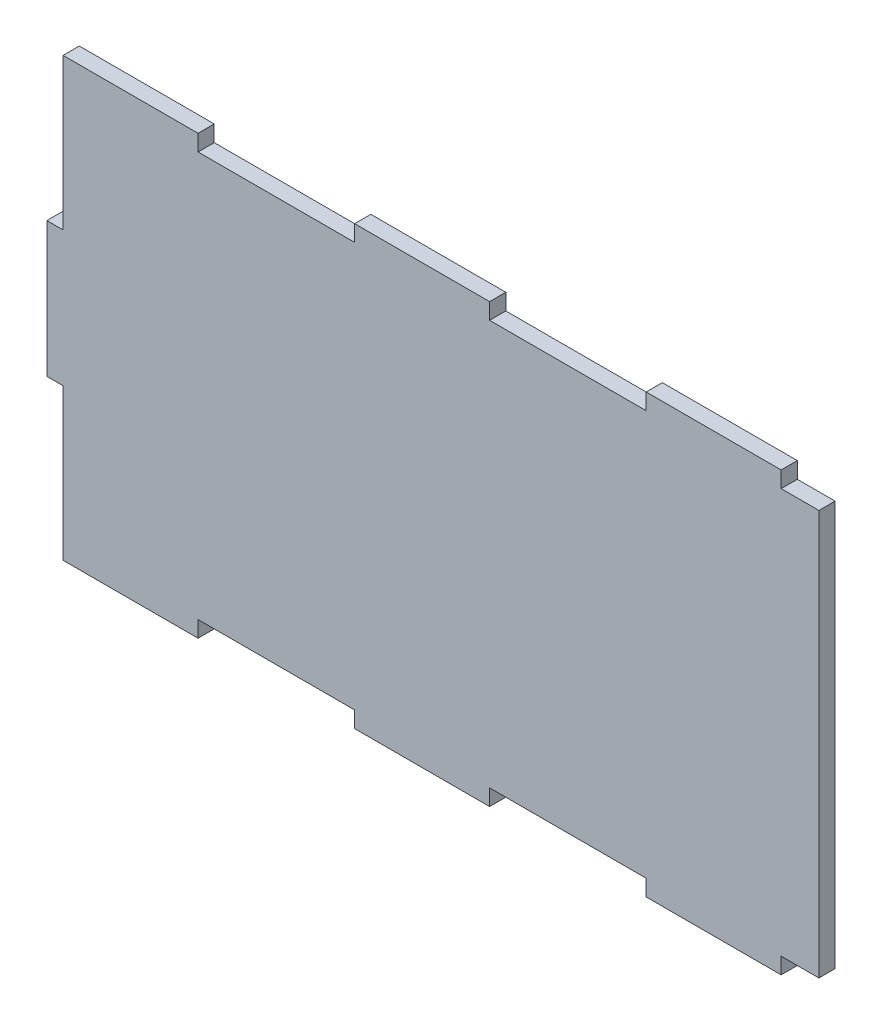
ISO-10303-21;
HEADER;
FILE_DESCRIPTION(('STEP AP214'),'2;1');
FILE_NAME('part.step','',(''),(''),'','','');
FILE_SCHEMA(('AUTOMOTIVE_DESIGN { 1 0 10303 214 1 1 1 1 }'));
ENDSEC;
DATA;
#1=APPLICATION_CONTEXT('core data for automotive mechanical design processes');
#2=APPLICATION_PROTOCOL_DEFINITION('international standard','automotive_design',2000,#1);
#3=PRODUCT_CONTEXT('',#1,'mechanical');
#4=PRODUCT('Part','Part','',(#3));
#5=PRODUCT_RELATED_PRODUCT_CATEGORY('part','',(#4));
#6=PRODUCT_DEFINITION_FORMATION('','',#4);
#7=PRODUCT_DEFINITION_CONTEXT('part definition',#1,'design');
#8=PRODUCT_DEFINITION('design','',#6,#7);
#9=PRODUCT_DEFINITION_SHAPE('','',#8);
#10=(LENGTH_UNIT() NAMED_UNIT(*) SI_UNIT(.MILLI.,.METRE.));
#11=(NAMED_UNIT(*) PLANE_ANGLE_UNIT() SI_UNIT($,.RADIAN.));
#12=(NAMED_UNIT(*) SI_UNIT($,.STERADIAN.) SOLID_ANGLE_UNIT());
#13=UNCERTAINTY_MEASURE_WITH_UNIT(LENGTH_MEASURE(1.E-05),#10,'distance_accuracy_value','');
#14=(GEOMETRIC_REPRESENTATION_CONTEXT(3) GLOBAL_UNCERTAINTY_ASSIGNED_CONTEXT((#13)) GLOBAL_UNIT_ASSIGNED_CONTEXT((#10,
#11,#12)) REPRESENTATION_CONTEXT('',''));
#15=CARTESIAN_POINT('',(0.,0.,0.));
#16=DIRECTION('',(0.,0.,1.));
#17=DIRECTION('',(1.,0.,0.));
#18=AXIS2_PLACEMENT_3D('',#15,#16,#17);
#19=CARTESIAN_POINT('',(133.,0.,6.));
#20=DIRECTION('',(1.,0.,0.));
#21=DIRECTION('',(0.,0.,-1.));
#22=AXIS2_PLACEMENT_3D('',#19,#20,#21);
#23=PLANE('',#22);
#24=DIRECTION('',(0.,-1.,0.));
#25=VECTOR('',#24,1.);
#26=CARTESIAN_POINT('',(133.,0.,0.));
#27=LINE('',#26,#25);
#28=CARTESIAN_POINT('',(133.,-75.,0.));
#29=VERTEX_POINT('',#28);
#30=CARTESIAN_POINT('',(133.,-81.,0.));
#31=VERTEX_POINT('',#30);
#32=EDGE_CURVE('E171',#29,#31,#27,.T.);
#33=ORIENTED_EDGE('',*,*,#32,.F.);
#34=DIRECTION('',(0.,0.,1.));
#35=VECTOR('',#34,1.);
#36=CARTESIAN_POINT('',(133.,-75.,0.));
#37=LINE('',#36,#35);
#38=CARTESIAN_POINT('',(133.,-75.,6.));
#39=VERTEX_POINT('',#38);
#40=EDGE_CURVE('E370',#29,#39,#37,.T.);
#41=ORIENTED_EDGE('',*,*,#40,.T.);
#42=DIRECTION('',(0.,-1.,0.));
#43=VECTOR('',#42,1.);
#44=CARTESIAN_POINT('',(133.,0.,6.));
#45=LINE('',#44,#43);
#46=CARTESIAN_POINT('',(133.,-81.,6.));
#47=VERTEX_POINT('',#46);
#48=EDGE_CURVE('E255',#39,#47,#45,.T.);
#49=ORIENTED_EDGE('',*,*,#48,.T.);
#50=DIRECTION('',(0.,0.,-1.));
#51=VECTOR('',#50,1.);
#52=CARTESIAN_POINT('',(133.,-81.,6.));
#53=LINE('',#52,#51);
#54=EDGE_CURVE('E248',#47,#31,#53,.T.);
#55=ORIENTED_EDGE('',*,*,#54,.T.);
#56=EDGE_LOOP('',(#33,#41,#49,#55));
#57=FACE_BOUND('',#56,.T.);
#58=ADVANCED_FACE('F113',(#57),#23,.T.);
#59=CARTESIAN_POINT('',(0.,75.,6.));
#60=DIRECTION('',(0.,1.,0.));
#61=DIRECTION('',(-1.,0.,0.));
#62=AXIS2_PLACEMENT_3D('',#59,#60,#61);
#63=PLANE('',#62);
#64=DIRECTION('',(0.,0.,1.));
#65=VECTOR('',#64,1.);
#66=CARTESIAN_POINT('',(83.0000000000001,75.,6.));
#67=LINE('',#66,#65);
#68=CARTESIAN_POINT('',(83.0000000000001,75.,0.));
#69=VERTEX_POINT('',#68);
#70=CARTESIAN_POINT('',(83.0000000000001,75.,6.));
#71=VERTEX_POINT('',#70);
#72=EDGE_CURVE('E12',#69,#71,#67,.T.);
#73=ORIENTED_EDGE('',*,*,#72,.F.);
#74=DIRECTION('',(1.,0.,0.));
#75=VECTOR('',#74,1.);
#76=CARTESIAN_POINT('',(0.,75.,0.));
#77=LINE('',#76,#75);
#78=CARTESIAN_POINT('',(25.,75.,0.));
#79=VERTEX_POINT('',#78);
#80=EDGE_CURVE('E170',#79,#69,#77,.T.);
#81=ORIENTED_EDGE('',*,*,#80,.F.);
#82=DIRECTION('',(0.,0.,-1.));
#83=VECTOR('',#82,1.);
#84=CARTESIAN_POINT('',(25.,75.,6.));
#85=LINE('',#84,#83);
#86=CARTESIAN_POINT('',(25.,75.,6.));
#87=VERTEX_POINT('',#86);
#88=EDGE_CURVE('E122',#87,#79,#85,.T.);
#89=ORIENTED_EDGE('',*,*,#88,.F.);
#90=DIRECTION('',(1.,0.,0.));
#91=VECTOR('',#90,1.);
#92=CARTESIAN_POINT('',(0.,75.,6.));
#93=LINE('',#92,#91);
#94=EDGE_CURVE('E365',#87,#71,#93,.T.);
#95=ORIENTED_EDGE('',*,*,#94,.T.);
#96=EDGE_LOOP('',(#73,#81,#89,#95));
#97=FACE_BOUND('',#96,.T.);
#98=ADVANCED_FACE('F612',(#97),#63,.T.);
#99=CARTESIAN_POINT('',(25.,0.,6.));
#100=DIRECTION('',(-1.,0.,0.));
#101=DIRECTION('',(0.,0.,1.));
#102=AXIS2_PLACEMENT_3D('',#99,#100,#101);
#103=PLANE('',#102);
#104=DIRECTION('',(0.,1.,0.));
#105=VECTOR('',#104,1.);
#106=CARTESIAN_POINT('',(25.,0.,0.));
#107=LINE('',#106,#105);
#108=CARTESIAN_POINT('',(25.,81.,0.));
#109=VERTEX_POINT('',#108);
#110=EDGE_CURVE('E306',#79,#109,#107,.T.);
#111=ORIENTED_EDGE('',*,*,#110,.T.);
#112=DIRECTION('',(0.,0.,-1.));
#113=VECTOR('',#112,1.);
#114=CARTESIAN_POINT('',(25.,81.,6.));
#115=LINE('',#114,#113);
#116=CARTESIAN_POINT('',(25.,81.,6.));
#117=VERTEX_POINT('',#116);
#118=EDGE_CURVE('E191',#117,#109,#115,.T.);
#119=ORIENTED_EDGE('',*,*,#118,.F.);
#120=DIRECTION('',(0.,1.,0.));
#121=VECTOR('',#120,1.);
#122=CARTESIAN_POINT('',(25.,0.,6.));
#123=LINE('',#122,#121);
#124=EDGE_CURVE('E362',#87,#117,#123,.T.);
#125=ORIENTED_EDGE('',*,*,#124,.F.);
#126=ORIENTED_EDGE('',*,*,#88,.T.);
#127=EDGE_LOOP('',(#111,#119,#125,#126));
#128=FACE_BOUND('',#127,.T.);
#129=ADVANCED_FACE('F609',(#128),#103,.F.);
#130=CARTESIAN_POINT('',(0.,81.,6.));
#131=DIRECTION('',(0.,1.,0.));
#132=DIRECTION('',(0.,0.,1.));
#133=AXIS2_PLACEMENT_3D('',#130,#131,#132);
#134=PLANE('',#133);
#135=DIRECTION('',(1.,0.,0.));
#136=VECTOR('',#135,1.);
#137=CARTESIAN_POINT('',(0.,81.,0.));
#138=LINE('',#137,#136);
#139=CARTESIAN_POINT('',(-25.,81.,0.));
#140=VERTEX_POINT('',#139);
#141=EDGE_CURVE('E303',#140,#109,#138,.T.);
#142=ORIENTED_EDGE('',*,*,#141,.F.);
#143=DIRECTION('',(0.,0.,-1.));
#144=VECTOR('',#143,1.);
#145=CARTESIAN_POINT('',(-25.,81.,6.));
#146=LINE('',#145,#144);
#147=CARTESIAN_POINT('',(-25.,81.,6.));
#148=VERTEX_POINT('',#147);
#149=EDGE_CURVE('E194',#148,#140,#146,.T.);
#150=ORIENTED_EDGE('',*,*,#149,.F.);
#151=DIRECTION('',(1.,0.,0.));
#152=VECTOR('',#151,1.);
#153=CARTESIAN_POINT('',(0.,81.,6.));
#154=LINE('',#153,#152);
#155=EDGE_CURVE('E359',#148,#117,#154,.T.);
#156=ORIENTED_EDGE('',*,*,#155,.T.);
#157=ORIENTED_EDGE('',*,*,#118,.T.);
#158=EDGE_LOOP('',(#142,#150,#156,#157));
#159=FACE_BOUND('',#158,.T.);
#160=ADVANCED_FACE('F604',(#159),#134,.T.);
#161=CARTESIAN_POINT('',(-25.,0.,6.));
#162=DIRECTION('',(-1.,0.,0.));
#163=DIRECTION('',(0.,0.,1.));
#164=AXIS2_PLACEMENT_3D('',#161,#162,#163);
#165=PLANE('',#164);
#166=DIRECTION('',(0.,1.,0.));
#167=VECTOR('',#166,1.);
#168=CARTESIAN_POINT('',(-25.,0.,0.));
#169=LINE('',#168,#167);
#170=CARTESIAN_POINT('',(-25.,75.,0.));
#171=VERTEX_POINT('',#170);
#172=EDGE_CURVE('E300',#171,#140,#169,.T.);
#173=ORIENTED_EDGE('',*,*,#172,.F.);
#174=DIRECTION('',(0.,0.,-1.));
#175=VECTOR('',#174,1.);
#176=CARTESIAN_POINT('',(-25.,75.,6.));
#177=LINE('',#176,#175);
#178=CARTESIAN_POINT('',(-25.,75.,6.));
#179=VERTEX_POINT('',#178);
#180=EDGE_CURVE('E197',#179,#171,#177,.T.);
#181=ORIENTED_EDGE('',*,*,#180,.F.);
#182=DIRECTION('',(0.,1.,0.));
#183=VECTOR('',#182,1.);
#184=CARTESIAN_POINT('',(-25.,0.,6.));
#185=LINE('',#184,#183);
#186=EDGE_CURVE('E356',#179,#148,#185,.T.);
#187=ORIENTED_EDGE('',*,*,#186,.T.);
#188=ORIENTED_EDGE('',*,*,#149,.T.);
#189=EDGE_LOOP('',(#173,#181,#187,#188));
#190=FACE_BOUND('',#189,.T.);
#191=ADVANCED_FACE('F599',(#190),#165,.T.);
#192=CARTESIAN_POINT('',(-82.9999999999999,75.,0.));
#193=VERTEX_POINT('',#192);
#194=EDGE_CURVE('E299',#193,#171,#77,.T.);
#195=ORIENTED_EDGE('',*,*,#194,.F.);
#196=DIRECTION('',(0.,0.,-1.));
#197=VECTOR('',#196,1.);
#198=CARTESIAN_POINT('',(-82.9999999999999,75.,6.));
#199=LINE('',#198,#197);
#200=CARTESIAN_POINT('',(-82.9999999999999,75.,6.));
#201=VERTEX_POINT('',#200);
#202=EDGE_CURVE('E200',#201,#193,#199,.T.);
#203=ORIENTED_EDGE('',*,*,#202,.F.);
#204=EDGE_CURVE('E355',#201,#179,#93,.T.);
#205=ORIENTED_EDGE('',*,*,#204,.T.);
#206=ORIENTED_EDGE('',*,*,#180,.T.);
#207=EDGE_LOOP('',(#195,#203,#205,#206));
#208=FACE_BOUND('',#207,.T.);
#209=ADVANCED_FACE('F593',(#208),#63,.T.);
#210=CARTESIAN_POINT('',(-82.9999999999999,0.,6.));
#211=DIRECTION('',(-1.,0.,0.));
#212=DIRECTION('',(0.,0.,1.));
#213=AXIS2_PLACEMENT_3D('',#210,#211,#212);
#214=PLANE('',#213);
#215=DIRECTION('',(0.,1.,0.));
#216=VECTOR('',#215,1.);
#217=CARTESIAN_POINT('',(-82.9999999999999,0.,0.));
#218=LINE('',#217,#216);
#219=CARTESIAN_POINT('',(-82.9999999999999,81.,0.));
#220=VERTEX_POINT('',#219);
#221=EDGE_CURVE('E296',#193,#220,#218,.T.);
#222=ORIENTED_EDGE('',*,*,#221,.T.);
#223=DIRECTION('',(0.,0.,-1.));
#224=VECTOR('',#223,1.);
#225=CARTESIAN_POINT('',(-82.9999999999999,81.,6.));
#226=LINE('',#225,#224);
#227=CARTESIAN_POINT('',(-82.9999999999999,81.,6.));
#228=VERTEX_POINT('',#227);
#229=EDGE_CURVE('E203',#228,#220,#226,.T.);
#230=ORIENTED_EDGE('',*,*,#229,.F.);
#231=DIRECTION('',(0.,1.,0.));
#232=VECTOR('',#231,1.);
#233=CARTESIAN_POINT('',(-82.9999999999999,0.,6.));
#234=LINE('',#233,#232);
#235=EDGE_CURVE('E352',#201,#228,#234,.T.);
#236=ORIENTED_EDGE('',*,*,#235,.F.);
#237=ORIENTED_EDGE('',*,*,#202,.T.);
#238=EDGE_LOOP('',(#222,#230,#236,#237));
#239=FACE_BOUND('',#238,.T.);
#240=ADVANCED_FACE('F589',(#239),#214,.F.);
#241=CARTESIAN_POINT('',(0.,81.,6.));
#242=DIRECTION('',(0.,1.,0.));
#243=DIRECTION('',(0.,0.,1.));
#244=AXIS2_PLACEMENT_3D('',#241,#242,#243);
#245=PLANE('',#244);
#246=DIRECTION('',(1.,0.,0.));
#247=VECTOR('',#246,1.);
#248=CARTESIAN_POINT('',(0.,81.,0.));
#249=LINE('',#248,#247);
#250=CARTESIAN_POINT('',(-133.,81.,0.));
#251=VERTEX_POINT('',#250);
#252=EDGE_CURVE('E293',#251,#220,#249,.T.);
#253=ORIENTED_EDGE('',*,*,#252,.F.);
#254=DIRECTION('',(0.,0.,-1.));
#255=VECTOR('',#254,1.);
#256=CARTESIAN_POINT('',(-133.,81.,6.));
#257=LINE('',#256,#255);
#258=CARTESIAN_POINT('',(-133.,81.,6.));
#259=VERTEX_POINT('',#258);
#260=EDGE_CURVE('E206',#259,#251,#257,.T.);
#261=ORIENTED_EDGE('',*,*,#260,.F.);
#262=DIRECTION('',(1.,0.,0.));
#263=VECTOR('',#262,1.);
#264=CARTESIAN_POINT('',(0.,81.,6.));
#265=LINE('',#264,#263);
#266=EDGE_CURVE('E349',#259,#228,#265,.T.);
#267=ORIENTED_EDGE('',*,*,#266,.T.);
#268=ORIENTED_EDGE('',*,*,#229,.T.);
#269=EDGE_LOOP('',(#253,#261,#267,#268));
#270=FACE_BOUND('',#269,.T.);
#271=ADVANCED_FACE('F584',(#270),#245,.T.);
#272=CARTESIAN_POINT('',(-133.,0.,6.));
#273=DIRECTION('',(1.,0.,0.));
#274=DIRECTION('',(0.,0.,-1.));
#275=AXIS2_PLACEMENT_3D('',#272,#273,#274);
#276=PLANE('',#275);
#277=DIRECTION('',(0.,-1.,0.));
#278=VECTOR('',#277,1.);
#279=CARTESIAN_POINT('',(-133.,0.,0.));
#280=LINE('',#279,#278);
#281=CARTESIAN_POINT('',(-133.,25.,0.));
#282=VERTEX_POINT('',#281);
#283=EDGE_CURVE('E290',#251,#282,#280,.T.);
#284=ORIENTED_EDGE('',*,*,#283,.T.);
#285=DIRECTION('',(0.,0.,-1.));
#286=VECTOR('',#285,1.);
#287=CARTESIAN_POINT('',(-133.,25.,6.));
#288=LINE('',#287,#286);
#289=CARTESIAN_POINT('',(-133.,25.,6.));
#290=VERTEX_POINT('',#289);
#291=EDGE_CURVE('E209',#290,#282,#288,.T.);
#292=ORIENTED_EDGE('',*,*,#291,.F.);
#293=DIRECTION('',(0.,-1.,0.));
#294=VECTOR('',#293,1.);
#295=CARTESIAN_POINT('',(-133.,0.,6.));
#296=LINE('',#295,#294);
#297=EDGE_CURVE('E346',#259,#290,#296,.T.);
#298=ORIENTED_EDGE('',*,*,#297,.F.);
#299=ORIENTED_EDGE('',*,*,#260,.T.);
#300=EDGE_LOOP('',(#284,#292,#298,#299));
#301=FACE_BOUND('',#300,.T.);
#302=ADVANCED_FACE('F580',(#301),#276,.F.);
#303=CARTESIAN_POINT('',(0.,25.,6.));
#304=DIRECTION('',(0.,1.,0.));
#305=DIRECTION('',(0.,0.,1.));
#306=AXIS2_PLACEMENT_3D('',#303,#304,#305);
#307=PLANE('',#306);
#308=DIRECTION('',(1.,0.,0.));
#309=VECTOR('',#308,1.);
#310=CARTESIAN_POINT('',(0.,25.,0.));
#311=LINE('',#310,#309);
#312=CARTESIAN_POINT('',(-139.,25.,0.));
#313=VERTEX_POINT('',#312);
#314=EDGE_CURVE('E287',#313,#282,#311,.T.);
#315=ORIENTED_EDGE('',*,*,#314,.F.);
#316=DIRECTION('',(0.,0.,-1.));
#317=VECTOR('',#316,1.);
#318=CARTESIAN_POINT('',(-139.,25.,6.));
#319=LINE('',#318,#317);
#320=CARTESIAN_POINT('',(-139.,25.,6.));
#321=VERTEX_POINT('',#320);
#322=EDGE_CURVE('E212',#321,#313,#319,.T.);
#323=ORIENTED_EDGE('',*,*,#322,.F.);
#324=DIRECTION('',(1.,0.,0.));
#325=VECTOR('',#324,1.);
#326=CARTESIAN_POINT('',(0.,25.,6.));
#327=LINE('',#326,#325);
#328=EDGE_CURVE('E343',#321,#290,#327,.T.);
#329=ORIENTED_EDGE('',*,*,#328,.T.);
#330=ORIENTED_EDGE('',*,*,#291,.T.);
#331=EDGE_LOOP('',(#315,#323,#329,#330));
#332=FACE_BOUND('',#331,.T.);
#333=ADVANCED_FACE('F574',(#332),#307,.T.);
#334=CARTESIAN_POINT('',(-139.,0.,6.));
#335=DIRECTION('',(1.,0.,0.));
#336=DIRECTION('',(0.,0.,-1.));
#337=AXIS2_PLACEMENT_3D('',#334,#335,#336);
#338=PLANE('',#337);
#339=DIRECTION('',(0.,-1.,0.));
#340=VECTOR('',#339,1.);
#341=CARTESIAN_POINT('',(-139.,0.,0.));
#342=LINE('',#341,#340);
#343=CARTESIAN_POINT('',(-139.,-25.,0.));
#344=VERTEX_POINT('',#343);
#345=EDGE_CURVE('E284',#313,#344,#342,.T.);
#346=ORIENTED_EDGE('',*,*,#345,.T.);
#347=DIRECTION('',(0.,0.,-1.));
#348=VECTOR('',#347,1.);
#349=CARTESIAN_POINT('',(-139.,-25.,6.));
#350=LINE('',#349,#348);
#351=CARTESIAN_POINT('',(-139.,-25.,6.));
#352=VERTEX_POINT('',#351);
#353=EDGE_CURVE('E215',#352,#344,#350,.T.);
#354=ORIENTED_EDGE('',*,*,#353,.F.);
#355=DIRECTION('',(0.,-1.,0.));
#356=VECTOR('',#355,1.);
#357=CARTESIAN_POINT('',(-139.,0.,6.));
#358=LINE('',#357,#356);
#359=EDGE_CURVE('E340',#321,#352,#358,.T.);
#360=ORIENTED_EDGE('',*,*,#359,.F.);
#361=ORIENTED_EDGE('',*,*,#322,.T.);
#362=EDGE_LOOP('',(#346,#354,#360,#361));
#363=FACE_BOUND('',#362,.T.);
#364=ADVANCED_FACE('F613',(#363),#338,.F.);
#365=CARTESIAN_POINT('',(0.,-25.,6.));
#366=DIRECTION('',(0.,1.,0.));
#367=DIRECTION('',(0.,0.,1.));
#368=AXIS2_PLACEMENT_3D('',#365,#366,#367);
#369=PLANE('',#368);
#370=DIRECTION('',(1.,0.,0.));
#371=VECTOR('',#370,1.);
#372=CARTESIAN_POINT('',(0.,-25.,0.));
#373=LINE('',#372,#371);
#374=CARTESIAN_POINT('',(-133.,-25.,0.));
#375=VERTEX_POINT('',#374);
#376=EDGE_CURVE('E281',#344,#375,#373,.T.);
#377=ORIENTED_EDGE('',*,*,#376,.T.);
#378=DIRECTION('',(0.,0.,-1.));
#379=VECTOR('',#378,1.);
#380=CARTESIAN_POINT('',(-133.,-25.,6.));
#381=LINE('',#380,#379);
#382=CARTESIAN_POINT('',(-133.,-25.,6.));
#383=VERTEX_POINT('',#382);
#384=EDGE_CURVE('E218',#383,#375,#381,.T.);
#385=ORIENTED_EDGE('',*,*,#384,.F.);
#386=DIRECTION('',(1.,0.,0.));
#387=VECTOR('',#386,1.);
#388=CARTESIAN_POINT('',(0.,-25.,6.));
#389=LINE('',#388,#387);
#390=EDGE_CURVE('E337',#352,#383,#389,.T.);
#391=ORIENTED_EDGE('',*,*,#390,.F.);
#392=ORIENTED_EDGE('',*,*,#353,.T.);
#393=EDGE_LOOP('',(#377,#385,#391,#392));
#394=FACE_BOUND('',#393,.T.);
#395=ADVANCED_FACE('F567',(#394),#369,.F.);
#396=CARTESIAN_POINT('',(-133.,0.,6.));
#397=DIRECTION('',(1.,0.,0.));
#398=DIRECTION('',(0.,0.,-1.));
#399=AXIS2_PLACEMENT_3D('',#396,#397,#398);
#400=PLANE('',#399);
#401=DIRECTION('',(0.,-1.,0.));
#402=VECTOR('',#401,1.);
#403=CARTESIAN_POINT('',(-133.,0.,0.));
#404=LINE('',#403,#402);
#405=CARTESIAN_POINT('',(-133.,-81.,0.));
#406=VERTEX_POINT('',#405);
#407=EDGE_CURVE('E278',#375,#406,#404,.T.);
#408=ORIENTED_EDGE('',*,*,#407,.T.);
#409=DIRECTION('',(0.,0.,-1.));
#410=VECTOR('',#409,1.);
#411=CARTESIAN_POINT('',(-133.,-81.,6.));
#412=LINE('',#411,#410);
#413=CARTESIAN_POINT('',(-133.,-81.,6.));
#414=VERTEX_POINT('',#413);
#415=EDGE_CURVE('E221',#414,#406,#412,.T.);
#416=ORIENTED_EDGE('',*,*,#415,.F.);
#417=DIRECTION('',(0.,-1.,0.));
#418=VECTOR('',#417,1.);
#419=CARTESIAN_POINT('',(-133.,0.,6.));
#420=LINE('',#419,#418);
#421=EDGE_CURVE('E334',#383,#414,#420,.T.);
#422=ORIENTED_EDGE('',*,*,#421,.F.);
#423=ORIENTED_EDGE('',*,*,#384,.T.);
#424=EDGE_LOOP('',(#408,#416,#422,#423));
#425=FACE_BOUND('',#424,.T.);
#426=ADVANCED_FACE('F563',(#425),#400,.F.);
#427=CARTESIAN_POINT('',(0.,-81.,6.));
#428=DIRECTION('',(0.,1.,0.));
#429=DIRECTION('',(0.,0.,1.));
#430=AXIS2_PLACEMENT_3D('',#427,#428,#429);
#431=PLANE('',#430);
#432=DIRECTION('',(1.,0.,0.));
#433=VECTOR('',#432,1.);
#434=CARTESIAN_POINT('',(0.,-81.,0.));
#435=LINE('',#434,#433);
#436=CARTESIAN_POINT('',(-82.9999999999999,-81.,0.));
#437=VERTEX_POINT('',#436);
#438=EDGE_CURVE('E275',#406,#437,#435,.T.);
#439=ORIENTED_EDGE('',*,*,#438,.T.);
#440=DIRECTION('',(0.,0.,-1.));
#441=VECTOR('',#440,1.);
#442=CARTESIAN_POINT('',(-82.9999999999999,-81.,6.));
#443=LINE('',#442,#441);
#444=CARTESIAN_POINT('',(-82.9999999999999,-81.,6.));
#445=VERTEX_POINT('',#444);
#446=EDGE_CURVE('E224',#445,#437,#443,.T.);
#447=ORIENTED_EDGE('',*,*,#446,.F.);
#448=DIRECTION('',(1.,0.,0.));
#449=VECTOR('',#448,1.);
#450=CARTESIAN_POINT('',(0.,-81.,6.));
#451=LINE('',#450,#449);
#452=EDGE_CURVE('E331',#414,#445,#451,.T.);
#453=ORIENTED_EDGE('',*,*,#452,.F.);
#454=ORIENTED_EDGE('',*,*,#415,.T.);
#455=EDGE_LOOP('',(#439,#447,#453,#454));
#456=FACE_BOUND('',#455,.T.);
#457=ADVANCED_FACE('F558',(#456),#431,.F.);
#458=CARTESIAN_POINT('',(-82.9999999999999,0.,6.));
#459=DIRECTION('',(1.,0.,0.));
#460=DIRECTION('',(0.,0.,-1.));
#461=AXIS2_PLACEMENT_3D('',#458,#459,#460);
#462=PLANE('',#461);
#463=DIRECTION('',(0.,-1.,0.));
#464=VECTOR('',#463,1.);
#465=CARTESIAN_POINT('',(-82.9999999999999,0.,0.));
#466=LINE('',#465,#464);
#467=CARTESIAN_POINT('',(-82.9999999999999,-75.,0.));
#468=VERTEX_POINT('',#467);
#469=EDGE_CURVE('E272',#468,#437,#466,.T.);
#470=ORIENTED_EDGE('',*,*,#469,.F.);
#471=DIRECTION('',(0.,0.,-1.));
#472=VECTOR('',#471,1.);
#473=CARTESIAN_POINT('',(-82.9999999999999,-75.,6.));
#474=LINE('',#473,#472);
#475=CARTESIAN_POINT('',(-82.9999999999999,-75.,6.));
#476=VERTEX_POINT('',#475);
#477=EDGE_CURVE('E227',#476,#468,#474,.T.);
#478=ORIENTED_EDGE('',*,*,#477,.F.);
#479=DIRECTION('',(0.,-1.,0.));
#480=VECTOR('',#479,1.);
#481=CARTESIAN_POINT('',(-82.9999999999999,0.,6.));
#482=LINE('',#481,#480);
#483=EDGE_CURVE('E328',#476,#445,#482,.T.);
#484=ORIENTED_EDGE('',*,*,#483,.T.);
#485=ORIENTED_EDGE('',*,*,#446,.T.);
#486=EDGE_LOOP('',(#470,#478,#484,#485));
#487=FACE_BOUND('',#486,.T.);
#488=ADVANCED_FACE('F552',(#487),#462,.T.);
#489=CARTESIAN_POINT('',(0.,-75.,6.));
#490=DIRECTION('',(0.,1.,0.));
#491=DIRECTION('',(-1.,0.,0.));
#492=AXIS2_PLACEMENT_3D('',#489,#490,#491);
#493=PLANE('',#492);
#494=DIRECTION('',(1.,0.,0.));
#495=VECTOR('',#494,1.);
#496=CARTESIAN_POINT('',(0.,-75.,0.));
#497=LINE('',#496,#495);
#498=CARTESIAN_POINT('',(-25.,-75.,0.));
#499=VERTEX_POINT('',#498);
#500=EDGE_CURVE('E269',#468,#499,#497,.T.);
#501=ORIENTED_EDGE('',*,*,#500,.T.);
#502=DIRECTION('',(0.,0.,-1.));
#503=VECTOR('',#502,1.);
#504=CARTESIAN_POINT('',(-25.,-75.,6.));
#505=LINE('',#504,#503);
#506=CARTESIAN_POINT('',(-25.,-75.,6.));
#507=VERTEX_POINT('',#506);
#508=EDGE_CURVE('E230',#507,#499,#505,.T.);
#509=ORIENTED_EDGE('',*,*,#508,.F.);
#510=DIRECTION('',(1.,0.,0.));
#511=VECTOR('',#510,1.);
#512=CARTESIAN_POINT('',(0.,-75.,6.));
#513=LINE('',#512,#511);
#514=EDGE_CURVE('E325',#476,#507,#513,.T.);
#515=ORIENTED_EDGE('',*,*,#514,.F.);
#516=ORIENTED_EDGE('',*,*,#477,.T.);
#517=EDGE_LOOP('',(#501,#509,#515,#516));
#518=FACE_BOUND('',#517,.T.);
#519=ADVANCED_FACE('F549',(#518),#493,.F.);
#520=CARTESIAN_POINT('',(-25.,0.,6.));
#521=DIRECTION('',(1.,0.,0.));
#522=DIRECTION('',(0.,0.,-1.));
#523=AXIS2_PLACEMENT_3D('',#520,#521,#522);
#524=PLANE('',#523);
#525=DIRECTION('',(0.,-1.,0.));
#526=VECTOR('',#525,1.);
#527=CARTESIAN_POINT('',(-25.,0.,0.));
#528=LINE('',#527,#526);
#529=CARTESIAN_POINT('',(-25.,-81.,0.));
#530=VERTEX_POINT('',#529);
#531=EDGE_CURVE('E266',#499,#530,#528,.T.);
#532=ORIENTED_EDGE('',*,*,#531,.T.);
#533=DIRECTION('',(0.,0.,-1.));
#534=VECTOR('',#533,1.);
#535=CARTESIAN_POINT('',(-25.,-81.,6.));
#536=LINE('',#535,#534);
#537=CARTESIAN_POINT('',(-25.,-81.,6.));
#538=VERTEX_POINT('',#537);
#539=EDGE_CURVE('E233',#538,#530,#536,.T.);
#540=ORIENTED_EDGE('',*,*,#539,.F.);
#541=DIRECTION('',(0.,-1.,0.));
#542=VECTOR('',#541,1.);
#543=CARTESIAN_POINT('',(-25.,0.,6.));
#544=LINE('',#543,#542);
#545=EDGE_CURVE('E322',#507,#538,#544,.T.);
#546=ORIENTED_EDGE('',*,*,#545,.F.);
#547=ORIENTED_EDGE('',*,*,#508,.T.);
#548=EDGE_LOOP('',(#532,#540,#546,#547));
#549=FACE_BOUND('',#548,.T.);
#550=ADVANCED_FACE('F544',(#549),#524,.F.);
#551=CARTESIAN_POINT('',(0.,-81.,6.));
#552=DIRECTION('',(0.,1.,0.));
#553=DIRECTION('',(0.,0.,1.));
#554=AXIS2_PLACEMENT_3D('',#551,#552,#553);
#555=PLANE('',#554);
#556=DIRECTION('',(1.,0.,0.));
#557=VECTOR('',#556,1.);
#558=CARTESIAN_POINT('',(0.,-81.,0.));
#559=LINE('',#558,#557);
#560=CARTESIAN_POINT('',(25.,-81.,0.));
#561=VERTEX_POINT('',#560);
#562=EDGE_CURVE('E263',#530,#561,#559,.T.);
#563=ORIENTED_EDGE('',*,*,#562,.T.);
#564=DIRECTION('',(0.,0.,-1.));
#565=VECTOR('',#564,1.);
#566=CARTESIAN_POINT('',(25.,-81.,6.));
#567=LINE('',#566,#565);
#568=CARTESIAN_POINT('',(25.,-81.,6.));
#569=VERTEX_POINT('',#568);
#570=EDGE_CURVE('E236',#569,#561,#567,.T.);
#571=ORIENTED_EDGE('',*,*,#570,.F.);
#572=DIRECTION('',(1.,0.,0.));
#573=VECTOR('',#572,1.);
#574=CARTESIAN_POINT('',(0.,-81.,6.));
#575=LINE('',#574,#573);
#576=EDGE_CURVE('E319',#538,#569,#575,.T.);
#577=ORIENTED_EDGE('',*,*,#576,.F.);
#578=ORIENTED_EDGE('',*,*,#539,.T.);
#579=EDGE_LOOP('',(#563,#571,#577,#578));
#580=FACE_BOUND('',#579,.T.);
#581=ADVANCED_FACE('F538',(#580),#555,.F.);
#582=CARTESIAN_POINT('',(25.,0.,6.));
#583=DIRECTION('',(1.,0.,0.));
#584=DIRECTION('',(0.,0.,-1.));
#585=AXIS2_PLACEMENT_3D('',#582,#583,#584);
#586=PLANE('',#585);
#587=DIRECTION('',(0.,-1.,0.));
#588=VECTOR('',#587,1.);
#589=CARTESIAN_POINT('',(25.,0.,0.));
#590=LINE('',#589,#588);
#591=CARTESIAN_POINT('',(25.,-75.,0.));
#592=VERTEX_POINT('',#591);
#593=EDGE_CURVE('E260',#592,#561,#590,.T.);
#594=ORIENTED_EDGE('',*,*,#593,.F.);
#595=DIRECTION('',(0.,0.,-1.));
#596=VECTOR('',#595,1.);
#597=CARTESIAN_POINT('',(25.,-75.,6.));
#598=LINE('',#597,#596);
#599=CARTESIAN_POINT('',(25.,-75.,6.));
#600=VERTEX_POINT('',#599);
#601=EDGE_CURVE('E239',#600,#592,#598,.T.);
#602=ORIENTED_EDGE('',*,*,#601,.F.);
#603=DIRECTION('',(0.,-1.,0.));
#604=VECTOR('',#603,1.);
#605=CARTESIAN_POINT('',(25.,0.,6.));
#606=LINE('',#605,#604);
#607=EDGE_CURVE('E316',#600,#569,#606,.T.);
#608=ORIENTED_EDGE('',*,*,#607,.T.);
#609=ORIENTED_EDGE('',*,*,#570,.T.);
#610=EDGE_LOOP('',(#594,#602,#608,#609));
#611=FACE_BOUND('',#610,.T.);
#612=ADVANCED_FACE('F534',(#611),#586,.T.);
#613=CARTESIAN_POINT('',(83.0000000000001,-75.,0.));
#614=VERTEX_POINT('',#613);
#615=EDGE_CURVE('E259',#592,#614,#497,.T.);
#616=ORIENTED_EDGE('',*,*,#615,.T.);
#617=DIRECTION('',(0.,0.,-1.));
#618=VECTOR('',#617,1.);
#619=CARTESIAN_POINT('',(83.0000000000001,-75.,6.));
#620=LINE('',#619,#618);
#621=CARTESIAN_POINT('',(83.0000000000001,-75.,6.));
#622=VERTEX_POINT('',#621);
#623=EDGE_CURVE('E242',#622,#614,#620,.T.);
#624=ORIENTED_EDGE('',*,*,#623,.F.);
#625=EDGE_CURVE('E315',#600,#622,#513,.T.);
#626=ORIENTED_EDGE('',*,*,#625,.F.);
#627=ORIENTED_EDGE('',*,*,#601,.T.);
#628=EDGE_LOOP('',(#616,#624,#626,#627));
#629=FACE_BOUND('',#628,.T.);
#630=ADVANCED_FACE('F530',(#629),#493,.F.);
#631=CARTESIAN_POINT('',(83.0000000000001,0.,6.));
#632=DIRECTION('',(1.,0.,0.));
#633=DIRECTION('',(0.,0.,-1.));
#634=AXIS2_PLACEMENT_3D('',#631,#632,#633);
#635=PLANE('',#634);
#636=DIRECTION('',(0.,-1.,0.));
#637=VECTOR('',#636,1.);
#638=CARTESIAN_POINT('',(83.0000000000001,0.,0.));
#639=LINE('',#638,#637);
#640=CARTESIAN_POINT('',(83.0000000000001,-81.,0.));
#641=VERTEX_POINT('',#640);
#642=EDGE_CURVE('E256',#614,#641,#639,.T.);
#643=ORIENTED_EDGE('',*,*,#642,.T.);
#644=DIRECTION('',(0.,0.,-1.));
#645=VECTOR('',#644,1.);
#646=CARTESIAN_POINT('',(83.0000000000001,-81.,6.));
#647=LINE('',#646,#645);
#648=CARTESIAN_POINT('',(83.0000000000001,-81.,6.));
#649=VERTEX_POINT('',#648);
#650=EDGE_CURVE('E245',#649,#641,#647,.T.);
#651=ORIENTED_EDGE('',*,*,#650,.F.);
#652=DIRECTION('',(0.,-1.,0.));
#653=VECTOR('',#652,1.);
#654=CARTESIAN_POINT('',(83.0000000000001,0.,6.));
#655=LINE('',#654,#653);
#656=EDGE_CURVE('E312',#622,#649,#655,.T.);
#657=ORIENTED_EDGE('',*,*,#656,.F.);
#658=ORIENTED_EDGE('',*,*,#623,.T.);
#659=EDGE_LOOP('',(#643,#651,#657,#658));
#660=FACE_BOUND('',#659,.T.);
#661=ADVANCED_FACE('F528',(#660),#635,.F.);
#662=CARTESIAN_POINT('',(0.,-81.,6.));
#663=DIRECTION('',(0.,-1.,0.));
#664=DIRECTION('',(0.,0.,-1.));
#665=AXIS2_PLACEMENT_3D('',#662,#663,#664);
#666=PLANE('',#665);
#667=DIRECTION('',(-1.,0.,0.));
#668=VECTOR('',#667,1.);
#669=CARTESIAN_POINT('',(0.,-81.,0.));
#670=LINE('',#669,#668);
#671=EDGE_CURVE('E252',#31,#641,#670,.T.);
#672=ORIENTED_EDGE('',*,*,#671,.F.);
#673=ORIENTED_EDGE('',*,*,#54,.F.);
#674=DIRECTION('',(-1.,0.,0.));
#675=VECTOR('',#674,1.);
#676=CARTESIAN_POINT('',(0.,-81.,6.));
#677=LINE('',#676,#675);
#678=EDGE_CURVE('E251',#47,#649,#677,.T.);
#679=ORIENTED_EDGE('',*,*,#678,.T.);
#680=ORIENTED_EDGE('',*,*,#650,.T.);
#681=EDGE_LOOP('',(#672,#673,#679,#680));
#682=FACE_BOUND('',#681,.T.);
#683=ADVANCED_FACE('F417',(#682),#666,.T.);
#684=DIRECTION('',(0.,0.,1.));
#685=VECTOR('',#684,1.);
#686=CARTESIAN_POINT('',(133.,75.,0.));
#687=LINE('',#686,#685);
#688=CARTESIAN_POINT('',(133.,75.,0.));
#689=VERTEX_POINT('',#688);
#690=CARTESIAN_POINT('',(133.,75.,6.));
#691=VERTEX_POINT('',#690);
#692=EDGE_CURVE('E166',#689,#691,#687,.T.);
#693=ORIENTED_EDGE('',*,*,#692,.F.);
#694=CARTESIAN_POINT('',(133.,81.,0.));
#695=VERTEX_POINT('',#694);
#696=EDGE_CURVE('E159',#695,#689,#27,.T.);
#697=ORIENTED_EDGE('',*,*,#696,.F.);
#698=DIRECTION('',(0.,0.,-1.));
#699=VECTOR('',#698,1.);
#700=CARTESIAN_POINT('',(133.,81.,6.));
#701=LINE('',#700,#699);
#702=CARTESIAN_POINT('',(133.,81.,6.));
#703=VERTEX_POINT('',#702);
#704=EDGE_CURVE('E163',#703,#695,#701,.T.);
#705=ORIENTED_EDGE('',*,*,#704,.F.);
#706=EDGE_CURVE('E368',#703,#691,#45,.T.);
#707=ORIENTED_EDGE('',*,*,#706,.T.);
#708=EDGE_LOOP('',(#693,#697,#705,#707));
#709=FACE_BOUND('',#708,.T.);
#710=ADVANCED_FACE('F161',(#709),#23,.T.);
#711=CARTESIAN_POINT('',(0.,0.,0.));
#712=DIRECTION('',(0.,0.,1.));
#713=DIRECTION('',(1.,0.,0.));
#714=AXIS2_PLACEMENT_3D('',#711,#712,#713);
#715=PLANE('',#714);
#716=ORIENTED_EDGE('',*,*,#696,.T.);
#717=DIRECTION('',(-1.,0.,0.));
#718=VECTOR('',#717,1.);
#719=CARTESIAN_POINT('',(133.,75.,0.));
#720=LINE('',#719,#718);
#721=CARTESIAN_POINT('',(147.,75.,0.));
#722=VERTEX_POINT('',#721);
#723=EDGE_CURVE('E373',#722,#689,#720,.T.);
#724=ORIENTED_EDGE('',*,*,#723,.F.);
#725=DIRECTION('',(0.,1.,0.));
#726=VECTOR('',#725,1.);
#727=CARTESIAN_POINT('',(147.,-75.,0.));
#728=LINE('',#727,#726);
#729=CARTESIAN_POINT('',(147.,-75.,0.));
#730=VERTEX_POINT('',#729);
#731=EDGE_CURVE('E389',#730,#722,#728,.T.);
#732=ORIENTED_EDGE('',*,*,#731,.F.);
#733=DIRECTION('',(1.,0.,0.));
#734=VECTOR('',#733,1.);
#735=CARTESIAN_POINT('',(133.,-75.,0.));
#736=LINE('',#735,#734);
#737=EDGE_CURVE('E382',#29,#730,#736,.T.);
#738=ORIENTED_EDGE('',*,*,#737,.F.);
#739=ORIENTED_EDGE('',*,*,#32,.T.);
#740=ORIENTED_EDGE('',*,*,#671,.T.);
#741=ORIENTED_EDGE('',*,*,#642,.F.);
#742=ORIENTED_EDGE('',*,*,#615,.F.);
#743=ORIENTED_EDGE('',*,*,#593,.T.);
#744=ORIENTED_EDGE('',*,*,#562,.F.);
#745=ORIENTED_EDGE('',*,*,#531,.F.);
#746=ORIENTED_EDGE('',*,*,#500,.F.);
#747=ORIENTED_EDGE('',*,*,#469,.T.);
#748=ORIENTED_EDGE('',*,*,#438,.F.);
#749=ORIENTED_EDGE('',*,*,#407,.F.);
#750=ORIENTED_EDGE('',*,*,#376,.F.);
#751=ORIENTED_EDGE('',*,*,#345,.F.);
#752=ORIENTED_EDGE('',*,*,#314,.T.);
#753=ORIENTED_EDGE('',*,*,#283,.F.);
#754=ORIENTED_EDGE('',*,*,#252,.T.);
#755=ORIENTED_EDGE('',*,*,#221,.F.);
#756=ORIENTED_EDGE('',*,*,#194,.T.);
#757=ORIENTED_EDGE('',*,*,#172,.T.);
#758=ORIENTED_EDGE('',*,*,#141,.T.);
#759=ORIENTED_EDGE('',*,*,#110,.F.);
#760=ORIENTED_EDGE('',*,*,#80,.T.);
#761=DIRECTION('',(0.,1.,0.));
#762=VECTOR('',#761,1.);
#763=CARTESIAN_POINT('',(83.0000000000001,75.,0.));
#764=LINE('',#763,#762);
#765=CARTESIAN_POINT('',(83.0000000000001,81.,0.));
#766=VERTEX_POINT('',#765);
#767=EDGE_CURVE('E182',#69,#766,#764,.T.);
#768=ORIENTED_EDGE('',*,*,#767,.T.);
#769=DIRECTION('',(-1.,0.,0.));
#770=VECTOR('',#769,1.);
#771=CARTESIAN_POINT('',(133.,81.,0.));
#772=LINE('',#771,#770);
#773=EDGE_CURVE('E177',#695,#766,#772,.T.);
#774=ORIENTED_EDGE('',*,*,#773,.F.);
#775=EDGE_LOOP('',(#716,#724,#732,#738,#739,#740,#741,#742,#743,#744,#745,#746,#747,#748,#749,
#750,#751,#752,#753,#754,#755,#756,#757,#758,#759,#760,#768,#774));
#776=FACE_BOUND('',#775,.T.);
#777=ADVANCED_FACE('F180',(#776),#715,.F.);
#778=CARTESIAN_POINT('',(0.,0.,6.));
#779=DIRECTION('',(0.,0.,1.));
#780=DIRECTION('',(1.,0.,0.));
#781=AXIS2_PLACEMENT_3D('',#778,#779,#780);
#782=PLANE('',#781);
#783=ORIENTED_EDGE('',*,*,#706,.F.);
#784=DIRECTION('',(-1.,0.,0.));
#785=VECTOR('',#784,1.);
#786=CARTESIAN_POINT('',(133.,81.,6.));
#787=LINE('',#786,#785);
#788=CARTESIAN_POINT('',(83.0000000000001,81.,6.));
#789=VERTEX_POINT('',#788);
#790=EDGE_CURVE('E179',#703,#789,#787,.T.);
#791=ORIENTED_EDGE('',*,*,#790,.T.);
#792=DIRECTION('',(0.,1.,0.));
#793=VECTOR('',#792,1.);
#794=CARTESIAN_POINT('',(83.0000000000001,75.,6.));
#795=LINE('',#794,#793);
#796=EDGE_CURVE('E183',#71,#789,#795,.T.);
#797=ORIENTED_EDGE('',*,*,#796,.F.);
#798=ORIENTED_EDGE('',*,*,#94,.F.);
#799=ORIENTED_EDGE('',*,*,#124,.T.);
#800=ORIENTED_EDGE('',*,*,#155,.F.);
#801=ORIENTED_EDGE('',*,*,#186,.F.);
#802=ORIENTED_EDGE('',*,*,#204,.F.);
#803=ORIENTED_EDGE('',*,*,#235,.T.);
#804=ORIENTED_EDGE('',*,*,#266,.F.);
#805=ORIENTED_EDGE('',*,*,#297,.T.);
#806=ORIENTED_EDGE('',*,*,#328,.F.);
#807=ORIENTED_EDGE('',*,*,#359,.T.);
#808=ORIENTED_EDGE('',*,*,#390,.T.);
#809=ORIENTED_EDGE('',*,*,#421,.T.);
#810=ORIENTED_EDGE('',*,*,#452,.T.);
#811=ORIENTED_EDGE('',*,*,#483,.F.);
#812=ORIENTED_EDGE('',*,*,#514,.T.);
#813=ORIENTED_EDGE('',*,*,#545,.T.);
#814=ORIENTED_EDGE('',*,*,#576,.T.);
#815=ORIENTED_EDGE('',*,*,#607,.F.);
#816=ORIENTED_EDGE('',*,*,#625,.T.);
#817=ORIENTED_EDGE('',*,*,#656,.T.);
#818=ORIENTED_EDGE('',*,*,#678,.F.);
#819=ORIENTED_EDGE('',*,*,#48,.F.);
#820=DIRECTION('',(1.,0.,0.));
#821=VECTOR('',#820,1.);
#822=CARTESIAN_POINT('',(133.,-75.,6.));
#823=LINE('',#822,#821);
#824=CARTESIAN_POINT('',(147.,-75.,6.));
#825=VERTEX_POINT('',#824);
#826=EDGE_CURVE('E130',#39,#825,#823,.T.);
#827=ORIENTED_EDGE('',*,*,#826,.T.);
#828=DIRECTION('',(0.,1.,0.));
#829=VECTOR('',#828,1.);
#830=CARTESIAN_POINT('',(147.,-75.,6.));
#831=LINE('',#830,#829);
#832=CARTESIAN_POINT('',(147.,75.,6.));
#833=VERTEX_POINT('',#832);
#834=EDGE_CURVE('E383',#825,#833,#831,.T.);
#835=ORIENTED_EDGE('',*,*,#834,.T.);
#836=DIRECTION('',(-1.,0.,0.));
#837=VECTOR('',#836,1.);
#838=CARTESIAN_POINT('',(133.,75.,6.));
#839=LINE('',#838,#837);
#840=EDGE_CURVE('E379',#833,#691,#839,.T.);
#841=ORIENTED_EDGE('',*,*,#840,.T.);
#842=EDGE_LOOP('',(#783,#791,#797,#798,#799,#800,#801,#802,#803,#804,#805,#806,#807,#808,#809,
#810,#811,#812,#813,#814,#815,#816,#817,#818,#819,#827,#835,#841));
#843=FACE_BOUND('',#842,.T.);
#844=ADVANCED_FACE('F522',(#843),#782,.T.);
#845=CARTESIAN_POINT('',(133.,81.,6.));
#846=DIRECTION('',(0.,-1.,0.));
#847=DIRECTION('',(0.,0.,-1.));
#848=AXIS2_PLACEMENT_3D('',#845,#846,#847);
#849=PLANE('',#848);
#850=ORIENTED_EDGE('',*,*,#773,.T.);
#851=DIRECTION('',(0.,0.,-1.));
#852=VECTOR('',#851,1.);
#853=CARTESIAN_POINT('',(83.0000000000001,81.,6.));
#854=LINE('',#853,#852);
#855=EDGE_CURVE('E117',#789,#766,#854,.T.);
#856=ORIENTED_EDGE('',*,*,#855,.F.);
#857=ORIENTED_EDGE('',*,*,#790,.F.);
#858=ORIENTED_EDGE('',*,*,#704,.T.);
#859=EDGE_LOOP('',(#850,#856,#857,#858));
#860=FACE_BOUND('',#859,.T.);
#861=ADVANCED_FACE('F175',(#860),#849,.F.);
#862=CARTESIAN_POINT('',(83.0000000000001,75.,6.));
#863=DIRECTION('',(-1.,0.,0.));
#864=DIRECTION('',(0.,0.,1.));
#865=AXIS2_PLACEMENT_3D('',#862,#863,#864);
#866=PLANE('',#865);
#867=ORIENTED_EDGE('',*,*,#767,.F.);
#868=ORIENTED_EDGE('',*,*,#72,.T.);
#869=ORIENTED_EDGE('',*,*,#796,.T.);
#870=ORIENTED_EDGE('',*,*,#855,.T.);
#871=EDGE_LOOP('',(#867,#868,#869,#870));
#872=FACE_BOUND('',#871,.T.);
#873=ADVANCED_FACE('F115',(#872),#866,.T.);
#874=CARTESIAN_POINT('',(133.,75.,0.));
#875=DIRECTION('',(0.,1.,0.));
#876=DIRECTION('',(0.,0.,1.));
#877=AXIS2_PLACEMENT_3D('',#874,#875,#876);
#878=PLANE('',#877);
#879=ORIENTED_EDGE('',*,*,#840,.F.);
#880=DIRECTION('',(0.,0.,1.));
#881=VECTOR('',#880,1.);
#882=CARTESIAN_POINT('',(147.,75.,0.));
#883=LINE('',#882,#881);
#884=EDGE_CURVE('E375',#722,#833,#883,.T.);
#885=ORIENTED_EDGE('',*,*,#884,.F.);
#886=ORIENTED_EDGE('',*,*,#723,.T.);
#887=ORIENTED_EDGE('',*,*,#692,.T.);
#888=EDGE_LOOP('',(#879,#885,#886,#887));
#889=FACE_BOUND('',#888,.T.);
#890=ADVANCED_FACE('F518',(#889),#878,.T.);
#891=CARTESIAN_POINT('',(147.,-75.,0.));
#892=DIRECTION('',(1.,0.,0.));
#893=DIRECTION('',(0.,0.,-1.));
#894=AXIS2_PLACEMENT_3D('',#891,#892,#893);
#895=PLANE('',#894);
#896=ORIENTED_EDGE('',*,*,#834,.F.);
#897=DIRECTION('',(0.,0.,1.));
#898=VECTOR('',#897,1.);
#899=CARTESIAN_POINT('',(147.,-75.,0.));
#900=LINE('',#899,#898);
#901=EDGE_CURVE('E372',#730,#825,#900,.T.);
#902=ORIENTED_EDGE('',*,*,#901,.F.);
#903=ORIENTED_EDGE('',*,*,#731,.T.);
#904=ORIENTED_EDGE('',*,*,#884,.T.);
#905=EDGE_LOOP('',(#896,#902,#903,#904));
#906=FACE_BOUND('',#905,.T.);
#907=ADVANCED_FACE('F520',(#906),#895,.T.);
#908=CARTESIAN_POINT('',(133.,-75.,0.));
#909=DIRECTION('',(0.,-1.,0.));
#910=DIRECTION('',(0.,0.,-1.));
#911=AXIS2_PLACEMENT_3D('',#908,#909,#910);
#912=PLANE('',#911);
#913=ORIENTED_EDGE('',*,*,#826,.F.);
#914=ORIENTED_EDGE('',*,*,#40,.F.);
#915=ORIENTED_EDGE('',*,*,#737,.T.);
#916=ORIENTED_EDGE('',*,*,#901,.T.);
#917=EDGE_LOOP('',(#913,#914,#915,#916));
#918=FACE_BOUND('',#917,.T.);
#919=ADVANCED_FACE('F395',(#918),#912,.T.);
#920=CLOSED_SHELL('',(#58,#98,#129,#160,#191,#209,#240,#271,#302,#333,#364,#395,#426,#457,#488,
#519,#550,#581,#612,#630,#661,#683,#710,#777,#844,#861,#873,#890,#907,#919));
#921=MANIFOLD_SOLID_BREP('B2',#920);
#922=ADVANCED_BREP_SHAPE_REPRESENTATION('',(#18,#921),#14);
#923=SHAPE_DEFINITION_REPRESENTATION(#9,#922);
ENDSEC;
END-ISO-10303-21;
